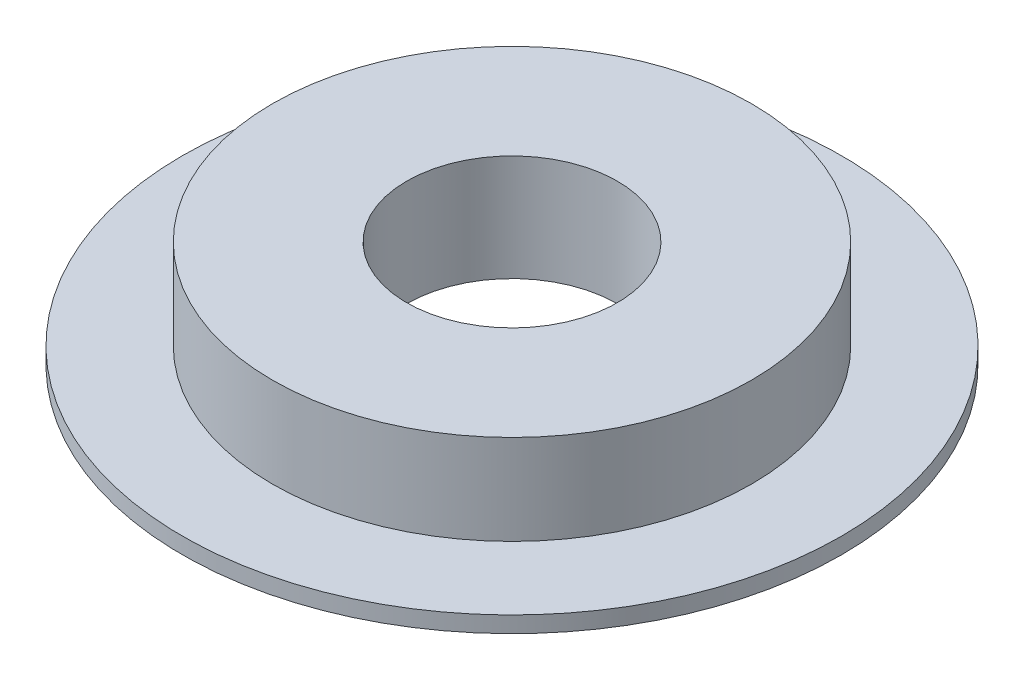
ISO-10303-21;
HEADER;
FILE_DESCRIPTION(('STEP AP214'),'2;1');
FILE_NAME('part.step','',(''),(''),'','','');
FILE_SCHEMA(('AUTOMOTIVE_DESIGN { 1 0 10303 214 1 1 1 1 }'));
ENDSEC;
DATA;
#1=APPLICATION_CONTEXT('core data for automotive mechanical design processes');
#2=APPLICATION_PROTOCOL_DEFINITION('international standard','automotive_design',2000,#1);
#3=PRODUCT_CONTEXT('',#1,'mechanical');
#4=PRODUCT('Part','Part','',(#3));
#5=PRODUCT_RELATED_PRODUCT_CATEGORY('part','',(#4));
#6=PRODUCT_DEFINITION_FORMATION('','',#4);
#7=PRODUCT_DEFINITION_CONTEXT('part definition',#1,'design');
#8=PRODUCT_DEFINITION('design','',#6,#7);
#9=PRODUCT_DEFINITION_SHAPE('','',#8);
#10=(LENGTH_UNIT() NAMED_UNIT(*) SI_UNIT(.MILLI.,.METRE.));
#11=(NAMED_UNIT(*) PLANE_ANGLE_UNIT() SI_UNIT($,.RADIAN.));
#12=(NAMED_UNIT(*) SI_UNIT($,.STERADIAN.) SOLID_ANGLE_UNIT());
#13=UNCERTAINTY_MEASURE_WITH_UNIT(LENGTH_MEASURE(1.E-05),#10,'distance_accuracy_value','');
#14=(GEOMETRIC_REPRESENTATION_CONTEXT(3) GLOBAL_UNCERTAINTY_ASSIGNED_CONTEXT((#13)) GLOBAL_UNIT_ASSIGNED_CONTEXT((#10,
#11,#12)) REPRESENTATION_CONTEXT('',''));
#15=CARTESIAN_POINT('',(0.,0.,0.));
#16=DIRECTION('',(0.,0.,1.));
#17=DIRECTION('',(1.,0.,0.));
#18=AXIS2_PLACEMENT_3D('',#15,#16,#17);
#19=CARTESIAN_POINT('',(-41.1215872800419,8.97288931788123,0.));
#20=DIRECTION('',(0.,1.,0.));
#21=DIRECTION('',(-1.,0.,0.));
#22=AXIS2_PLACEMENT_3D('',#19,#20,#21);
#23=PLANE('',#22);
#24=CARTESIAN_POINT('',(-29.4215872800419,8.97288931788123,0.));
#25=DIRECTION('',(0.,1.,0.));
#26=DIRECTION('',(-1.,0.,0.));
#27=AXIS2_PLACEMENT_3D('',#24,#25,#26);
#28=CIRCLE('',#27,26.6);
#29=CARTESIAN_POINT('',(-56.0215872800419,8.97288931788123,0.));
#30=VERTEX_POINT('',#29);
#31=EDGE_CURVE('E10',#30,#30,#28,.T.);
#32=ORIENTED_EDGE('',*,*,#31,.T.);
#33=EDGE_LOOP('',(#32));
#34=FACE_BOUND('',#33,.T.);
#35=CARTESIAN_POINT('',(-29.4215872800419,8.97288931788123,0.));
#36=DIRECTION('',(0.,1.,0.));
#37=DIRECTION('',(-1.,0.,0.));
#38=AXIS2_PLACEMENT_3D('',#35,#36,#37);
#39=CIRCLE('',#38,11.7);
#40=CARTESIAN_POINT('',(-41.1215872800419,8.97288931788123,0.));
#41=VERTEX_POINT('',#40);
#42=EDGE_CURVE('E53',#41,#41,#39,.T.);
#43=ORIENTED_EDGE('',*,*,#42,.F.);
#44=EDGE_LOOP('',(#43));
#45=FACE_BOUND('',#44,.T.);
#46=ADVANCED_FACE('F31',(#34,#45),#23,.T.);
#47=CARTESIAN_POINT('',(-29.4215872800419,13.9728893178812,0.));
#48=DIRECTION('',(0.,1.,0.));
#49=DIRECTION('',(-1.,0.,0.));
#50=AXIS2_PLACEMENT_3D('',#47,#48,#49);
#51=CYLINDRICAL_SURFACE('',#50,26.6);
#52=CARTESIAN_POINT('',(-29.4215872800419,-1.02711068211877,0.));
#53=DIRECTION('',(0.,1.,0.));
#54=DIRECTION('',(-1.,0.,0.));
#55=AXIS2_PLACEMENT_3D('',#52,#53,#54);
#56=CIRCLE('',#55,26.6);
#57=CARTESIAN_POINT('',(-56.0215872800419,-1.02711068211877,0.));
#58=VERTEX_POINT('',#57);
#59=EDGE_CURVE('E37',#58,#58,#56,.T.);
#60=ORIENTED_EDGE('',*,*,#59,.T.);
#61=EDGE_LOOP('',(#60));
#62=FACE_BOUND('',#61,.T.);
#63=ORIENTED_EDGE('',*,*,#31,.F.);
#64=EDGE_LOOP('',(#63));
#65=FACE_BOUND('',#64,.T.);
#66=ADVANCED_FACE('F61',(#62,#65),#51,.T.);
#67=CARTESIAN_POINT('',(-56.0215872800419,-1.02711068211877,0.));
#68=DIRECTION('',(0.,1.,0.));
#69=DIRECTION('',(-1.,0.,0.));
#70=AXIS2_PLACEMENT_3D('',#67,#68,#69);
#71=PLANE('',#70);
#72=CARTESIAN_POINT('',(-29.4215872800419,-1.02711068211877,0.));
#73=DIRECTION('',(0.,1.,0.));
#74=DIRECTION('',(-1.,0.,0.));
#75=AXIS2_PLACEMENT_3D('',#72,#73,#74);
#76=CIRCLE('',#75,36.6);
#77=CARTESIAN_POINT('',(-66.0215872800419,-1.02711068211877,0.));
#78=VERTEX_POINT('',#77);
#79=EDGE_CURVE('E41',#78,#78,#76,.T.);
#80=ORIENTED_EDGE('',*,*,#79,.T.);
#81=EDGE_LOOP('',(#80));
#82=FACE_BOUND('',#81,.T.);
#83=ORIENTED_EDGE('',*,*,#59,.F.);
#84=EDGE_LOOP('',(#83));
#85=FACE_BOUND('',#84,.T.);
#86=ADVANCED_FACE('F65',(#82,#85),#71,.T.);
#87=CARTESIAN_POINT('',(-29.4215872800419,13.9728893178812,0.));
#88=DIRECTION('',(0.,1.,0.));
#89=DIRECTION('',(-1.,0.,0.));
#90=AXIS2_PLACEMENT_3D('',#87,#88,#89);
#91=CYLINDRICAL_SURFACE('',#90,36.6);
#92=CARTESIAN_POINT('',(-29.4215872800419,-2.82711068211877,0.));
#93=DIRECTION('',(0.,1.,0.));
#94=DIRECTION('',(-1.,0.,0.));
#95=AXIS2_PLACEMENT_3D('',#92,#93,#94);
#96=CIRCLE('',#95,36.6);
#97=CARTESIAN_POINT('',(-66.0215872800419,-2.82711068211877,0.));
#98=VERTEX_POINT('',#97);
#99=EDGE_CURVE('E45',#98,#98,#96,.T.);
#100=ORIENTED_EDGE('',*,*,#99,.T.);
#101=EDGE_LOOP('',(#100));
#102=FACE_BOUND('',#101,.T.);
#103=ORIENTED_EDGE('',*,*,#79,.F.);
#104=EDGE_LOOP('',(#103));
#105=FACE_BOUND('',#104,.T.);
#106=ADVANCED_FACE('F69',(#102,#105),#91,.T.);
#107=CARTESIAN_POINT('',(-66.0215872800419,-2.82711068211877,0.));
#108=DIRECTION('',(0.,-1.,0.));
#109=DIRECTION('',(1.,0.,0.));
#110=AXIS2_PLACEMENT_3D('',#107,#108,#109);
#111=PLANE('',#110);
#112=CARTESIAN_POINT('',(-29.4215872800419,-2.82711068211877,0.));
#113=DIRECTION('',(0.,1.,0.));
#114=DIRECTION('',(-1.,0.,0.));
#115=AXIS2_PLACEMENT_3D('',#112,#113,#114);
#116=CIRCLE('',#115,11.7);
#117=CARTESIAN_POINT('',(-41.1215872800419,-2.82711068211877,0.));
#118=VERTEX_POINT('',#117);
#119=EDGE_CURVE('E50',#118,#118,#116,.T.);
#120=ORIENTED_EDGE('',*,*,#119,.T.);
#121=EDGE_LOOP('',(#120));
#122=FACE_BOUND('',#121,.T.);
#123=ORIENTED_EDGE('',*,*,#99,.F.);
#124=EDGE_LOOP('',(#123));
#125=FACE_BOUND('',#124,.T.);
#126=ADVANCED_FACE('F76',(#122,#125),#111,.T.);
#127=CARTESIAN_POINT('',(-29.4215872800419,13.9728893178812,0.));
#128=DIRECTION('',(0.,1.,0.));
#129=DIRECTION('',(-1.,0.,0.));
#130=AXIS2_PLACEMENT_3D('',#127,#128,#129);
#131=CYLINDRICAL_SURFACE('',#130,11.7);
#132=ORIENTED_EDGE('',*,*,#42,.T.);
#133=EDGE_LOOP('',(#132));
#134=FACE_BOUND('',#133,.T.);
#135=ORIENTED_EDGE('',*,*,#119,.F.);
#136=EDGE_LOOP('',(#135));
#137=FACE_BOUND('',#136,.T.);
#138=ADVANCED_FACE('F57',(#134,#137),#131,.F.);
#139=CLOSED_SHELL('',(#46,#66,#86,#106,#126,#138));
#140=MANIFOLD_SOLID_BREP('B2',#139);
#141=ADVANCED_BREP_SHAPE_REPRESENTATION('',(#18,#140),#14);
#142=SHAPE_DEFINITION_REPRESENTATION(#9,#141);
ENDSEC;
END-ISO-10303-21;
